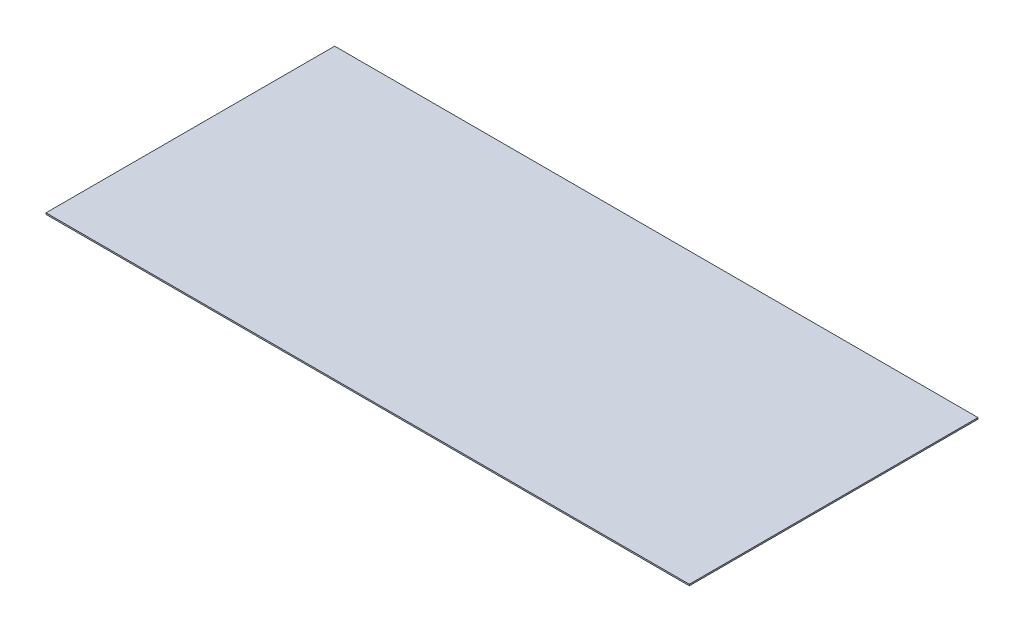
ISO-10303-21;
HEADER;
FILE_DESCRIPTION(('STEP AP214'),'2;1');
FILE_NAME('part.step','',(''),(''),'','','');
FILE_SCHEMA(('AUTOMOTIVE_DESIGN { 1 0 10303 214 1 1 1 1 }'));
ENDSEC;
DATA;
#1=APPLICATION_CONTEXT('core data for automotive mechanical design processes');
#2=APPLICATION_PROTOCOL_DEFINITION('international standard','automotive_design',2000,#1);
#3=PRODUCT_CONTEXT('',#1,'mechanical');
#4=PRODUCT('Part','Part','',(#3));
#5=PRODUCT_RELATED_PRODUCT_CATEGORY('part','',(#4));
#6=PRODUCT_DEFINITION_FORMATION('','',#4);
#7=PRODUCT_DEFINITION_CONTEXT('part definition',#1,'design');
#8=PRODUCT_DEFINITION('design','',#6,#7);
#9=PRODUCT_DEFINITION_SHAPE('','',#8);
#10=(LENGTH_UNIT() NAMED_UNIT(*) SI_UNIT(.MILLI.,.METRE.));
#11=(NAMED_UNIT(*) PLANE_ANGLE_UNIT() SI_UNIT($,.RADIAN.));
#12=(NAMED_UNIT(*) SI_UNIT($,.STERADIAN.) SOLID_ANGLE_UNIT());
#13=UNCERTAINTY_MEASURE_WITH_UNIT(LENGTH_MEASURE(1.E-05),#10,'distance_accuracy_value','');
#14=(GEOMETRIC_REPRESENTATION_CONTEXT(3) GLOBAL_UNCERTAINTY_ASSIGNED_CONTEXT((#13)) GLOBAL_UNIT_ASSIGNED_CONTEXT((#10,
#11,#12)) REPRESENTATION_CONTEXT('',''));
#15=CARTESIAN_POINT('',(0.,0.,0.));
#16=DIRECTION('',(0.,0.,1.));
#17=DIRECTION('',(1.,0.,0.));
#18=AXIS2_PLACEMENT_3D('',#15,#16,#17);
#19=CARTESIAN_POINT('',(724.922052175803,1.5875,7.70987714166327));
#20=DIRECTION('',(-1.,0.,0.));
#21=DIRECTION('',(0.,0.,1.));
#22=AXIS2_PLACEMENT_3D('',#19,#20,#21);
#23=PLANE('',#22);
#24=DIRECTION('',(0.,0.,-1.));
#25=VECTOR('',#24,1.);
#26=CARTESIAN_POINT('',(724.922052175803,0.,7.70987714166327));
#27=LINE('',#26,#25);
#28=CARTESIAN_POINT('',(724.922052175803,0.,7.70987714166327));
#29=VERTEX_POINT('',#28);
#30=CARTESIAN_POINT('',(724.922052175803,0.,-314.362122858337));
#31=VERTEX_POINT('',#30);
#32=EDGE_CURVE('E97',#29,#31,#27,.T.);
#33=ORIENTED_EDGE('',*,*,#32,.T.);
#34=DIRECTION('',(0.,-1.,0.));
#35=VECTOR('',#34,1.);
#36=CARTESIAN_POINT('',(724.922052175803,1.5875,-314.362122858337));
#37=LINE('',#36,#35);
#38=CARTESIAN_POINT('',(724.922052175803,1.5875,-314.362122858337));
#39=VERTEX_POINT('',#38);
#40=EDGE_CURVE('E11',#39,#31,#37,.T.);
#41=ORIENTED_EDGE('',*,*,#40,.F.);
#42=DIRECTION('',(0.,0.,-1.));
#43=VECTOR('',#42,1.);
#44=CARTESIAN_POINT('',(724.922052175803,1.5875,7.70987714166327));
#45=LINE('',#44,#43);
#46=CARTESIAN_POINT('',(724.922052175803,1.5875,7.70987714166327));
#47=VERTEX_POINT('',#46);
#48=EDGE_CURVE('E83',#47,#39,#45,.T.);
#49=ORIENTED_EDGE('',*,*,#48,.F.);
#50=DIRECTION('',(0.,-1.,0.));
#51=VECTOR('',#50,1.);
#52=CARTESIAN_POINT('',(724.922052175803,1.5875,7.70987714166327));
#53=LINE('',#52,#51);
#54=EDGE_CURVE('E93',#47,#29,#53,.T.);
#55=ORIENTED_EDGE('',*,*,#54,.T.);
#56=EDGE_LOOP('',(#33,#41,#49,#55));
#57=FACE_BOUND('',#56,.T.);
#58=ADVANCED_FACE('F33',(#57),#23,.F.);
#59=CARTESIAN_POINT('',(7.11805217580336,1.5875,-314.362122858337));
#60=DIRECTION('',(0.,0.,1.));
#61=DIRECTION('',(1.,0.,0.));
#62=AXIS2_PLACEMENT_3D('',#59,#60,#61);
#63=PLANE('',#62);
#64=DIRECTION('',(-1.,0.,0.));
#65=VECTOR('',#64,1.);
#66=CARTESIAN_POINT('',(7.11805217580336,0.,-314.362122858337));
#67=LINE('',#66,#65);
#68=CARTESIAN_POINT('',(7.11805217580336,0.,-314.362122858337));
#69=VERTEX_POINT('',#68);
#70=EDGE_CURVE('E88',#31,#69,#67,.T.);
#71=ORIENTED_EDGE('',*,*,#70,.T.);
#72=DIRECTION('',(0.,-1.,0.));
#73=VECTOR('',#72,1.);
#74=CARTESIAN_POINT('',(7.11805217580336,1.5875,-314.362122858337));
#75=LINE('',#74,#73);
#76=CARTESIAN_POINT('',(7.11805217580336,1.5875,-314.362122858337));
#77=VERTEX_POINT('',#76);
#78=EDGE_CURVE('E41',#77,#69,#75,.T.);
#79=ORIENTED_EDGE('',*,*,#78,.F.);
#80=DIRECTION('',(-1.,0.,0.));
#81=VECTOR('',#80,1.);
#82=CARTESIAN_POINT('',(7.11805217580336,1.5875,-314.362122858337));
#83=LINE('',#82,#81);
#84=EDGE_CURVE('E77',#39,#77,#83,.T.);
#85=ORIENTED_EDGE('',*,*,#84,.F.);
#86=ORIENTED_EDGE('',*,*,#40,.T.);
#87=EDGE_LOOP('',(#71,#79,#85,#86));
#88=FACE_BOUND('',#87,.T.);
#89=ADVANCED_FACE('F87',(#88),#63,.F.);
#90=CARTESIAN_POINT('',(7.11805217580336,1.5875,-314.362122858337));
#91=DIRECTION('',(1.,0.,0.));
#92=DIRECTION('',(0.,0.,-1.));
#93=AXIS2_PLACEMENT_3D('',#90,#91,#92);
#94=PLANE('',#93);
#95=DIRECTION('',(0.,0.,1.));
#96=VECTOR('',#95,1.);
#97=CARTESIAN_POINT('',(7.11805217580336,0.,-314.362122858337));
#98=LINE('',#97,#96);
#99=CARTESIAN_POINT('',(7.11805217580336,0.,7.70987714166327));
#100=VERTEX_POINT('',#99);
#101=EDGE_CURVE('E101',#69,#100,#98,.T.);
#102=ORIENTED_EDGE('',*,*,#101,.T.);
#103=DIRECTION('',(0.,-1.,0.));
#104=VECTOR('',#103,1.);
#105=CARTESIAN_POINT('',(7.11805217580336,1.5875,7.70987714166327));
#106=LINE('',#105,#104);
#107=CARTESIAN_POINT('',(7.11805217580336,1.5875,7.70987714166327));
#108=VERTEX_POINT('',#107);
#109=EDGE_CURVE('E90',#108,#100,#106,.T.);
#110=ORIENTED_EDGE('',*,*,#109,.F.);
#111=DIRECTION('',(0.,0.,1.));
#112=VECTOR('',#111,1.);
#113=CARTESIAN_POINT('',(7.11805217580336,1.5875,-314.362122858337));
#114=LINE('',#113,#112);
#115=EDGE_CURVE('E80',#77,#108,#114,.T.);
#116=ORIENTED_EDGE('',*,*,#115,.F.);
#117=ORIENTED_EDGE('',*,*,#78,.T.);
#118=EDGE_LOOP('',(#102,#110,#116,#117));
#119=FACE_BOUND('',#118,.T.);
#120=ADVANCED_FACE('F91',(#119),#94,.F.);
#121=CARTESIAN_POINT('',(513.594052175803,1.5875,7.70987714166327));
#122=DIRECTION('',(0.,0.,-1.));
#123=DIRECTION('',(-1.,0.,0.));
#124=AXIS2_PLACEMENT_3D('',#121,#122,#123);
#125=PLANE('',#124);
#126=DIRECTION('',(1.,0.,0.));
#127=VECTOR('',#126,1.);
#128=CARTESIAN_POINT('',(513.594052175803,0.,7.70987714166327));
#129=LINE('',#128,#127);
#130=EDGE_CURVE('E66',#100,#29,#129,.T.);
#131=ORIENTED_EDGE('',*,*,#130,.T.);
#132=ORIENTED_EDGE('',*,*,#54,.F.);
#133=DIRECTION('',(1.,0.,0.));
#134=VECTOR('',#133,1.);
#135=CARTESIAN_POINT('',(7.11805217580336,1.5875,7.70987714166327));
#136=LINE('',#135,#134);
#137=EDGE_CURVE('E49',#108,#47,#136,.T.);
#138=ORIENTED_EDGE('',*,*,#137,.F.);
#139=ORIENTED_EDGE('',*,*,#109,.T.);
#140=EDGE_LOOP('',(#131,#132,#138,#139));
#141=FACE_BOUND('',#140,.T.);
#142=ADVANCED_FACE('F105',(#141),#125,.F.);
#143=CARTESIAN_POINT('',(0.,1.5875,0.));
#144=DIRECTION('',(0.,-1.,0.));
#145=DIRECTION('',(0.,0.,-1.));
#146=AXIS2_PLACEMENT_3D('',#143,#144,#145);
#147=PLANE('',#146);
#148=ORIENTED_EDGE('',*,*,#48,.T.);
#149=ORIENTED_EDGE('',*,*,#84,.T.);
#150=ORIENTED_EDGE('',*,*,#115,.T.);
#151=ORIENTED_EDGE('',*,*,#137,.T.);
#152=EDGE_LOOP('',(#148,#149,#150,#151));
#153=FACE_BOUND('',#152,.T.);
#154=ADVANCED_FACE('F78',(#153),#147,.F.);
#155=CARTESIAN_POINT('',(0.,0.,0.));
#156=DIRECTION('',(0.,-1.,0.));
#157=DIRECTION('',(0.,0.,-1.));
#158=AXIS2_PLACEMENT_3D('',#155,#156,#157);
#159=PLANE('',#158);
#160=ORIENTED_EDGE('',*,*,#32,.F.);
#161=ORIENTED_EDGE('',*,*,#130,.F.);
#162=ORIENTED_EDGE('',*,*,#101,.F.);
#163=ORIENTED_EDGE('',*,*,#70,.F.);
#164=EDGE_LOOP('',(#160,#161,#162,#163));
#165=FACE_BOUND('',#164,.T.);
#166=ADVANCED_FACE('F107',(#165),#159,.T.);
#167=CLOSED_SHELL('',(#58,#89,#120,#142,#154,#166));
#168=MANIFOLD_SOLID_BREP('B2',#167);
#169=ADVANCED_BREP_SHAPE_REPRESENTATION('',(#18,#168),#14);
#170=SHAPE_DEFINITION_REPRESENTATION(#9,#169);
ENDSEC;
END-ISO-10303-21;
